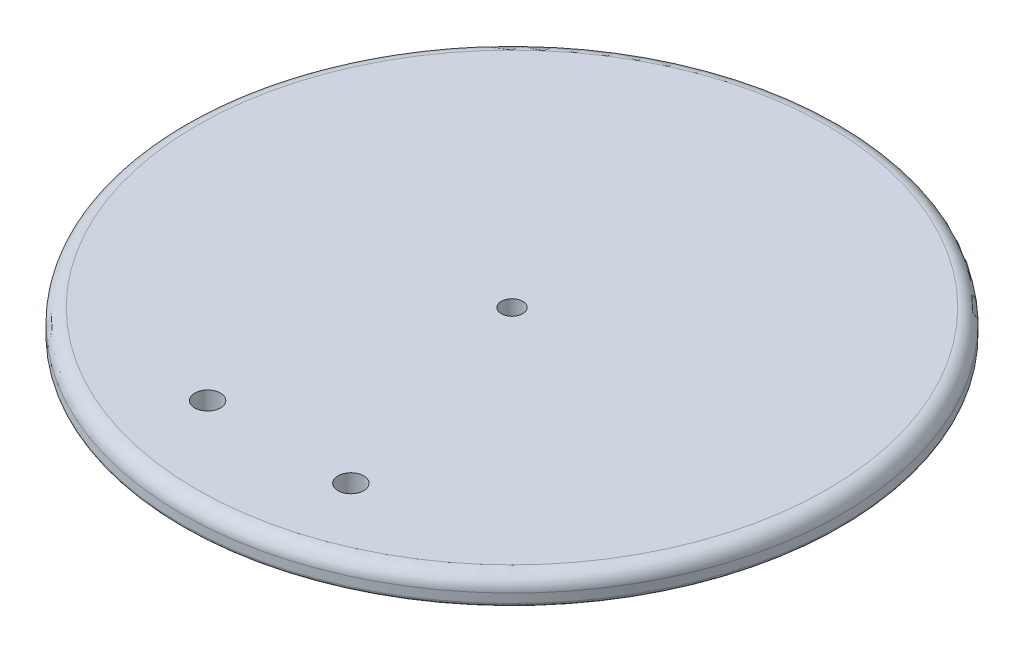
ISO-10303-21;
HEADER;
FILE_DESCRIPTION(('STEP AP214'),'2;1');
FILE_NAME('part.step','',(''),(''),'','','');
FILE_SCHEMA(('AUTOMOTIVE_DESIGN { 1 0 10303 214 1 1 1 1 }'));
ENDSEC;
DATA;
#1=APPLICATION_CONTEXT('core data for automotive mechanical design processes');
#2=APPLICATION_PROTOCOL_DEFINITION('international standard','automotive_design',2000,#1);
#3=PRODUCT_CONTEXT('',#1,'mechanical');
#4=PRODUCT('Part','Part','',(#3));
#5=PRODUCT_RELATED_PRODUCT_CATEGORY('part','',(#4));
#6=PRODUCT_DEFINITION_FORMATION('','',#4);
#7=PRODUCT_DEFINITION_CONTEXT('part definition',#1,'design');
#8=PRODUCT_DEFINITION('design','',#6,#7);
#9=PRODUCT_DEFINITION_SHAPE('','',#8);
#10=(LENGTH_UNIT() NAMED_UNIT(*) SI_UNIT(.MILLI.,.METRE.));
#11=(NAMED_UNIT(*) PLANE_ANGLE_UNIT() SI_UNIT($,.RADIAN.));
#12=(NAMED_UNIT(*) SI_UNIT($,.STERADIAN.) SOLID_ANGLE_UNIT());
#13=UNCERTAINTY_MEASURE_WITH_UNIT(LENGTH_MEASURE(1.E-05),#10,'distance_accuracy_value','');
#14=(GEOMETRIC_REPRESENTATION_CONTEXT(3) GLOBAL_UNCERTAINTY_ASSIGNED_CONTEXT((#13)) GLOBAL_UNIT_ASSIGNED_CONTEXT((#10,
#11,#12)) REPRESENTATION_CONTEXT('',''));
#15=CARTESIAN_POINT('',(0.,0.,0.));
#16=DIRECTION('',(0.,0.,1.));
#17=DIRECTION('',(1.,0.,0.));
#18=AXIS2_PLACEMENT_3D('',#15,#16,#17);
#19=CARTESIAN_POINT('',(59.332644984238,3.41374916925297,-36.8638511188806));
#20=DIRECTION('',(0.,1.,0.));
#21=DIRECTION('',(0.,0.,1.));
#22=AXIS2_PLACEMENT_3D('',#19,#20,#21);
#23=PLANE('',#22);
#24=CARTESIAN_POINT('',(59.332644984238,3.41374916925297,-36.8638511188806));
#25=DIRECTION('',(0.,1.,0.));
#26=DIRECTION('',(0.,0.,1.));
#27=AXIS2_PLACEMENT_3D('',#24,#25,#26);
#28=CIRCLE('',#27,57.785);
#29=CARTESIAN_POINT('',(59.332644984238,3.41374916925297,20.9211488811194));
#30=VERTEX_POINT('',#29);
#31=EDGE_CURVE('E11',#30,#30,#28,.F.);
#32=ORIENTED_EDGE('',*,*,#31,.T.);
#33=EDGE_LOOP('',(#32));
#34=FACE_BOUND('',#33,.T.);
#35=CARTESIAN_POINT('',(46.6326449842379,3.41374916925297,4.39807767939825));
#36=DIRECTION('',(0.,1.,0.));
#37=DIRECTION('',(0.,0.,1.));
#38=AXIS2_PLACEMENT_3D('',#35,#36,#37);
#39=CIRCLE('',#38,2.286);
#40=CARTESIAN_POINT('',(46.6326449842379,3.41374916925297,6.68407767939825));
#41=VERTEX_POINT('',#40);
#42=EDGE_CURVE('E220',#41,#41,#39,.F.);
#43=ORIENTED_EDGE('',*,*,#42,.F.);
#44=EDGE_LOOP('',(#43));
#45=FACE_BOUND('',#44,.T.);
#46=CARTESIAN_POINT('',(72.0326449842379,3.41374916925297,4.39807767939825));
#47=DIRECTION('',(0.,1.,0.));
#48=DIRECTION('',(0.,0.,1.));
#49=AXIS2_PLACEMENT_3D('',#46,#47,#48);
#50=CIRCLE('',#49,2.28599999999999);
#51=CARTESIAN_POINT('',(72.0326449842379,3.41374916925297,6.68407767939824));
#52=VERTEX_POINT('',#51);
#53=EDGE_CURVE('E219',#52,#52,#50,.F.);
#54=ORIENTED_EDGE('',*,*,#53,.F.);
#55=EDGE_LOOP('',(#54));
#56=FACE_BOUND('',#55,.T.);
#57=CARTESIAN_POINT('',(58.9768398177988,3.41374916925297,-37.0907340514422));
#58=DIRECTION('',(0.,1.,0.));
#59=DIRECTION('',(0.,0.,1.));
#60=AXIS2_PLACEMENT_3D('',#57,#58,#59);
#61=CIRCLE('',#60,6.39864801940768);
#62=CARTESIAN_POINT('',(55.4593357756066,3.41374916925297,-42.4358123286456));
#63=VERTEX_POINT('',#62);
#64=CARTESIAN_POINT('',(52.7610898787353,3.41374916925297,-38.6096643234767));
#65=VERTEX_POINT('',#64);
#66=EDGE_CURVE('E150',#63,#65,#61,.T.);
#67=ORIENTED_EDGE('',*,*,#66,.T.);
#68=CARTESIAN_POINT('',(58.9111504046938,3.41374916925297,-36.8434672780378));
#69=DIRECTION('',(0.,1.,0.));
#70=DIRECTION('',(0.,0.,1.));
#71=AXIS2_PLACEMENT_3D('',#68,#69,#70);
#72=CIRCLE('',#71,6.39864801940768);
#73=CARTESIAN_POINT('',(53.2046718908221,3.41374916925297,-33.948851682317));
#74=VERTEX_POINT('',#73);
#75=EDGE_CURVE('E139',#65,#74,#72,.T.);
#76=ORIENTED_EDGE('',*,*,#75,.T.);
#77=DIRECTION('',(-0.120272410735966,0.,0.992740926534088));
#78=VECTOR('',#77,1.);
#79=CARTESIAN_POINT('',(51.5432137530939,3.41374916925297,-20.2350042508657));
#80=LINE('',#79,#78);
#81=CARTESIAN_POINT('',(51.5432137530939,3.41374916925297,-20.2350042508657));
#82=VERTEX_POINT('',#81);
#83=EDGE_CURVE('E293',#74,#82,#80,.T.);
#84=ORIENTED_EDGE('',*,*,#83,.T.);
#85=CARTESIAN_POINT('',(54.9211326890478,3.41374916925297,-20.1029097134891));
#86=DIRECTION('',(0.,1.,0.));
#87=DIRECTION('',(0.,0.,1.));
#88=AXIS2_PLACEMENT_3D('',#85,#86,#87);
#89=CIRCLE('',#88,3.38050074762318);
#90=CARTESIAN_POINT('',(54.0147123283669,3.41374916925297,-16.8461955052074));
#91=VERTEX_POINT('',#90);
#92=EDGE_CURVE('E295',#82,#91,#89,.T.);
#93=ORIENTED_EDGE('',*,*,#92,.T.);
#94=CARTESIAN_POINT('',(54.8440998131529,3.41374916925297,-20.1233744299476));
#95=DIRECTION('',(0.,1.,0.));
#96=DIRECTION('',(0.,0.,1.));
#97=AXIS2_PLACEMENT_3D('',#94,#95,#96);
#98=CIRCLE('',#97,3.38050074762316);
#99=CARTESIAN_POINT('',(57.8422070726946,3.41374916925297,-18.5616003858028));
#100=VERTEX_POINT('',#99);
#101=EDGE_CURVE('E297',#91,#100,#98,.T.);
#102=ORIENTED_EDGE('',*,*,#101,.T.);
#103=DIRECTION('',(0.388279898284772,0.,-0.92154149151732));
#104=VECTOR('',#103,1.);
#105=CARTESIAN_POINT('',(57.8422070726946,3.41374916925297,-18.5616003858028));
#106=LINE('',#105,#104);
#107=CARTESIAN_POINT('',(63.2059541928693,3.41374916925297,-31.2918899091155));
#108=VERTEX_POINT('',#107);
#109=EDGE_CURVE('E302',#100,#108,#106,.T.);
#110=ORIENTED_EDGE('',*,*,#109,.T.);
#111=CARTESIAN_POINT('',(59.6884501506771,3.41374916925297,-36.6369681863189));
#112=DIRECTION('',(0.,1.,0.));
#113=DIRECTION('',(0.,0.,1.));
#114=AXIS2_PLACEMENT_3D('',#111,#112,#113);
#115=CIRCLE('',#114,6.39864801940768);
#116=CARTESIAN_POINT('',(65.9042000897406,3.41374916925297,-35.1180379142844));
#117=VERTEX_POINT('',#116);
#118=EDGE_CURVE('E305',#108,#117,#115,.T.);
#119=ORIENTED_EDGE('',*,*,#118,.T.);
#120=CARTESIAN_POINT('',(59.7541395637821,3.41374916925297,-36.8842349597234));
#121=DIRECTION('',(0.,1.,0.));
#122=DIRECTION('',(0.,0.,1.));
#123=AXIS2_PLACEMENT_3D('',#120,#121,#122);
#124=CIRCLE('',#123,6.39864801940769);
#125=CARTESIAN_POINT('',(65.4606180776538,3.41374916925297,-39.7788505554441));
#126=VERTEX_POINT('',#125);
#127=EDGE_CURVE('E308',#117,#126,#124,.T.);
#128=ORIENTED_EDGE('',*,*,#127,.T.);
#129=DIRECTION('',(0.120272410735967,0.,-0.992740926534088));
#130=VECTOR('',#129,1.);
#131=CARTESIAN_POINT('',(67.122076215382,3.41374916925297,-53.4926979868955));
#132=LINE('',#131,#130);
#133=CARTESIAN_POINT('',(67.122076215382,3.41374916925297,-53.4926979868955));
#134=VERTEX_POINT('',#133);
#135=EDGE_CURVE('E311',#126,#134,#132,.T.);
#136=ORIENTED_EDGE('',*,*,#135,.T.);
#137=CARTESIAN_POINT('',(63.7441572794281,3.41374916925297,-53.624792524272));
#138=DIRECTION('',(0.,1.,0.));
#139=DIRECTION('',(0.,0.,1.));
#140=AXIS2_PLACEMENT_3D('',#137,#138,#139);
#141=CIRCLE('',#140,3.38050074762317);
#142=CARTESIAN_POINT('',(64.650577640109,3.41374916925297,-56.8815067325537));
#143=VERTEX_POINT('',#142);
#144=EDGE_CURVE('E314',#134,#143,#141,.T.);
#145=ORIENTED_EDGE('',*,*,#144,.T.);
#146=CARTESIAN_POINT('',(63.8211901553229,3.41374916925297,-53.6043278078136));
#147=DIRECTION('',(0.,1.,0.));
#148=DIRECTION('',(0.,0.,1.));
#149=AXIS2_PLACEMENT_3D('',#146,#147,#148);
#150=CIRCLE('',#149,3.38050074762318);
#151=CARTESIAN_POINT('',(60.8230828957813,3.41374916925297,-55.1661018519583));
#152=VERTEX_POINT('',#151);
#153=EDGE_CURVE('E162',#143,#152,#150,.T.);
#154=ORIENTED_EDGE('',*,*,#153,.T.);
#155=DIRECTION('',(-0.388279898284767,0.,0.921541491517322));
#156=VECTOR('',#155,1.);
#157=CARTESIAN_POINT('',(60.8230828957813,3.41374916925297,-55.1661018519583));
#158=LINE('',#157,#156);
#159=EDGE_CURVE('E158',#152,#63,#158,.T.);
#160=ORIENTED_EDGE('',*,*,#159,.T.);
#161=EDGE_LOOP('',(#67,#76,#84,#93,#102,#110,#119,#128,#136,#145,#154,#160));
#162=FACE_BOUND('',#161,.T.);
#163=ADVANCED_FACE('F53',(#34,#45,#56,#162),#23,.F.);
#164=CARTESIAN_POINT('',(59.3326449842379,8.17624916925297,-36.8638511188806));
#165=DIRECTION('',(0.,1.,0.));
#166=DIRECTION('',(0.,0.,1.));
#167=AXIS2_PLACEMENT_3D('',#164,#165,#166);
#168=PLANE('',#167);
#169=CARTESIAN_POINT('',(72.0326449842379,8.17624916925297,4.39807767939825));
#170=DIRECTION('',(0.,1.,0.));
#171=DIRECTION('',(0.,0.,1.));
#172=AXIS2_PLACEMENT_3D('',#169,#170,#171);
#173=CIRCLE('',#172,2.28599999999999);
#174=CARTESIAN_POINT('',(72.0326449842379,8.17624916925297,6.68407767939824));
#175=VERTEX_POINT('',#174);
#176=EDGE_CURVE('E216',#175,#175,#173,.T.);
#177=ORIENTED_EDGE('',*,*,#176,.F.);
#178=EDGE_LOOP('',(#177));
#179=FACE_BOUND('',#178,.T.);
#180=CARTESIAN_POINT('',(46.6326449842379,8.17624916925297,4.39807767939825));
#181=DIRECTION('',(0.,1.,0.));
#182=DIRECTION('',(0.,0.,1.));
#183=AXIS2_PLACEMENT_3D('',#180,#181,#182);
#184=CIRCLE('',#183,2.286);
#185=CARTESIAN_POINT('',(46.6326449842379,8.17624916925297,6.68407767939825));
#186=VERTEX_POINT('',#185);
#187=EDGE_CURVE('E144',#186,#186,#184,.T.);
#188=ORIENTED_EDGE('',*,*,#187,.F.);
#189=EDGE_LOOP('',(#188));
#190=FACE_BOUND('',#189,.T.);
#191=CARTESIAN_POINT('',(59.332644984238,8.17624916925297,-36.8638511188806));
#192=DIRECTION('',(0.,1.,0.));
#193=DIRECTION('',(0.,0.,1.));
#194=AXIS2_PLACEMENT_3D('',#191,#192,#193);
#195=CIRCLE('',#194,55.88);
#196=CARTESIAN_POINT('',(59.332644984238,8.17624916925297,19.0161488811194));
#197=VERTEX_POINT('',#196);
#198=EDGE_CURVE('E231',#197,#197,#195,.T.);
#199=ORIENTED_EDGE('',*,*,#198,.T.);
#200=EDGE_LOOP('',(#199));
#201=FACE_BOUND('',#200,.T.);
#202=CARTESIAN_POINT('',(59.3326449842379,8.17624916925297,-36.8638511188806));
#203=DIRECTION('',(0.,1.,0.));
#204=DIRECTION('',(0.,0.,1.));
#205=AXIS2_PLACEMENT_3D('',#202,#203,#204);
#206=CIRCLE('',#205,1.905);
#207=CARTESIAN_POINT('',(59.3326449842379,8.17624916925297,-34.9588511188806));
#208=VERTEX_POINT('',#207);
#209=EDGE_CURVE('E223',#208,#208,#206,.F.);
#210=ORIENTED_EDGE('',*,*,#209,.T.);
#211=EDGE_LOOP('',(#210));
#212=FACE_BOUND('',#211,.T.);
#213=ADVANCED_FACE('F261',(#179,#190,#201,#212),#168,.T.);
#214=CARTESIAN_POINT('',(59.332644984238,12.938749169253,-36.8638511188806));
#215=DIRECTION('',(0.,-1.,0.));
#216=DIRECTION('',(0.,0.,-1.));
#217=AXIS2_PLACEMENT_3D('',#214,#215,#216);
#218=CYLINDRICAL_SURFACE('',#217,58.42);
#219=CARTESIAN_POINT('',(59.332644984238,4.04874916925297,-36.8638511188806));
#220=DIRECTION('',(0.,1.,0.));
#221=DIRECTION('',(0.,0.,1.));
#222=AXIS2_PLACEMENT_3D('',#219,#220,#221);
#223=CIRCLE('',#222,58.42);
#224=CARTESIAN_POINT('',(59.332644984238,4.04874916925297,21.5561488811194));
#225=VERTEX_POINT('',#224);
#226=EDGE_CURVE('E61',#225,#225,#223,.T.);
#227=ORIENTED_EDGE('',*,*,#226,.T.);
#228=EDGE_LOOP('',(#227));
#229=FACE_BOUND('',#228,.T.);
#230=CARTESIAN_POINT('',(59.332644984238,5.63624916925297,-36.8638511188806));
#231=DIRECTION('',(0.,1.,0.));
#232=DIRECTION('',(0.,0.,1.));
#233=AXIS2_PLACEMENT_3D('',#230,#231,#232);
#234=CIRCLE('',#233,58.42);
#235=CARTESIAN_POINT('',(59.332644984238,5.63624916925297,21.5561488811194));
#236=VERTEX_POINT('',#235);
#237=EDGE_CURVE('E236',#236,#236,#234,.F.);
#238=ORIENTED_EDGE('',*,*,#237,.T.);
#239=EDGE_LOOP('',(#238));
#240=FACE_BOUND('',#239,.T.);
#241=ADVANCED_FACE('F241',(#229,#240),#218,.T.);
#242=CARTESIAN_POINT('',(54.8843452901975,4.81545432470032,-20.1196504860645));
#243=DIRECTION('',(0.,1.,0.));
#244=DIRECTION('',(0.,0.,1.));
#245=AXIS2_PLACEMENT_3D('',#242,#243,#244);
#246=PLANE('',#245);
#247=CARTESIAN_POINT('',(59.3326449842379,4.81545432470032,-36.8638511188806));
#248=DIRECTION('',(0.,-1.,0.));
#249=DIRECTION('',(0.,0.,-1.));
#250=AXIS2_PLACEMENT_3D('',#247,#248,#249);
#251=CIRCLE('',#250,1.905);
#252=CARTESIAN_POINT('',(59.3326449842379,4.81545432470032,-38.7688511188806));
#253=VERTEX_POINT('',#252);
#254=EDGE_CURVE('E228',#253,#253,#251,.T.);
#255=ORIENTED_EDGE('',*,*,#254,.F.);
#256=EDGE_LOOP('',(#255));
#257=FACE_BOUND('',#256,.T.);
#258=CARTESIAN_POINT('',(58.9768398177988,4.81545432470032,-37.0907340514422));
#259=DIRECTION('',(0.,-1.,0.));
#260=DIRECTION('',(0.,0.,-1.));
#261=AXIS2_PLACEMENT_3D('',#258,#259,#260);
#262=CIRCLE('',#261,6.39864801940768);
#263=CARTESIAN_POINT('',(52.7610898787353,4.81545432470032,-38.6096643234767));
#264=VERTEX_POINT('',#263);
#265=CARTESIAN_POINT('',(55.4593357756066,4.81545432470032,-42.4358123286456));
#266=VERTEX_POINT('',#265);
#267=EDGE_CURVE('E153',#264,#266,#262,.T.);
#268=ORIENTED_EDGE('',*,*,#267,.T.);
#269=DIRECTION('',(0.388279898284767,0.,-0.921541491517322));
#270=VECTOR('',#269,1.);
#271=CARTESIAN_POINT('',(60.8230828957813,4.81545432470032,-55.1661018519583));
#272=LINE('',#271,#270);
#273=CARTESIAN_POINT('',(60.8230828957813,4.81545432470032,-55.1661018519583));
#274=VERTEX_POINT('',#273);
#275=EDGE_CURVE('E160',#266,#274,#272,.T.);
#276=ORIENTED_EDGE('',*,*,#275,.T.);
#277=CARTESIAN_POINT('',(63.8211901553229,4.81545432470032,-53.6043278078136));
#278=DIRECTION('',(0.,-1.,0.));
#279=DIRECTION('',(0.,0.,-1.));
#280=AXIS2_PLACEMENT_3D('',#277,#278,#279);
#281=CIRCLE('',#280,3.38050074762318);
#282=CARTESIAN_POINT('',(64.650577640109,4.81545432470032,-56.8815067325537));
#283=VERTEX_POINT('',#282);
#284=EDGE_CURVE('E168',#274,#283,#281,.T.);
#285=ORIENTED_EDGE('',*,*,#284,.T.);
#286=CARTESIAN_POINT('',(63.7441572794281,4.81545432470032,-53.624792524272));
#287=DIRECTION('',(0.,-1.,0.));
#288=DIRECTION('',(0.,0.,1.));
#289=AXIS2_PLACEMENT_3D('',#286,#287,#288);
#290=CIRCLE('',#289,3.38050074762317);
#291=CARTESIAN_POINT('',(67.122076215382,4.81545432470032,-53.4926979868955));
#292=VERTEX_POINT('',#291);
#293=EDGE_CURVE('E171',#283,#292,#290,.T.);
#294=ORIENTED_EDGE('',*,*,#293,.T.);
#295=DIRECTION('',(-0.120272410735967,0.,0.992740926534088));
#296=VECTOR('',#295,1.);
#297=CARTESIAN_POINT('',(67.122076215382,4.81545432470032,-53.4926979868955));
#298=LINE('',#297,#296);
#299=CARTESIAN_POINT('',(65.4606180776538,4.81545432470032,-39.7788505554441));
#300=VERTEX_POINT('',#299);
#301=EDGE_CURVE('E174',#292,#300,#298,.T.);
#302=ORIENTED_EDGE('',*,*,#301,.T.);
#303=CARTESIAN_POINT('',(59.7541395637821,4.81545432470032,-36.8842349597234));
#304=DIRECTION('',(0.,-1.,0.));
#305=DIRECTION('',(0.,0.,1.));
#306=AXIS2_PLACEMENT_3D('',#303,#304,#305);
#307=CIRCLE('',#306,6.39864801940769);
#308=CARTESIAN_POINT('',(65.9042000897406,4.81545432470032,-35.1180379142844));
#309=VERTEX_POINT('',#308);
#310=EDGE_CURVE('E177',#300,#309,#307,.T.);
#311=ORIENTED_EDGE('',*,*,#310,.T.);
#312=CARTESIAN_POINT('',(59.6884501506771,4.81545432470032,-36.6369681863189));
#313=DIRECTION('',(0.,-1.,0.));
#314=DIRECTION('',(0.,0.,-1.));
#315=AXIS2_PLACEMENT_3D('',#312,#313,#314);
#316=CIRCLE('',#315,6.39864801940768);
#317=CARTESIAN_POINT('',(63.2059541928693,4.81545432470032,-31.2918899091155));
#318=VERTEX_POINT('',#317);
#319=EDGE_CURVE('E180',#309,#318,#316,.T.);
#320=ORIENTED_EDGE('',*,*,#319,.T.);
#321=DIRECTION('',(-0.388279898284772,0.,0.92154149151732));
#322=VECTOR('',#321,1.);
#323=CARTESIAN_POINT('',(57.8422070726946,4.81545432470032,-18.5616003858028));
#324=LINE('',#323,#322);
#325=CARTESIAN_POINT('',(57.8422070726946,4.81545432470032,-18.5616003858028));
#326=VERTEX_POINT('',#325);
#327=EDGE_CURVE('E183',#318,#326,#324,.T.);
#328=ORIENTED_EDGE('',*,*,#327,.T.);
#329=CARTESIAN_POINT('',(54.8440998131529,4.81545432470032,-20.1233744299476));
#330=DIRECTION('',(0.,-1.,0.));
#331=DIRECTION('',(0.,0.,-1.));
#332=AXIS2_PLACEMENT_3D('',#329,#330,#331);
#333=CIRCLE('',#332,3.38050074762316);
#334=CARTESIAN_POINT('',(54.0147123283669,4.81545432470032,-16.8461955052074));
#335=VERTEX_POINT('',#334);
#336=EDGE_CURVE('E186',#326,#335,#333,.T.);
#337=ORIENTED_EDGE('',*,*,#336,.T.);
#338=CARTESIAN_POINT('',(54.9211326890478,4.81545432470032,-20.1029097134891));
#339=DIRECTION('',(0.,-1.,0.));
#340=DIRECTION('',(0.,0.,1.));
#341=AXIS2_PLACEMENT_3D('',#338,#339,#340);
#342=CIRCLE('',#341,3.38050074762318);
#343=CARTESIAN_POINT('',(51.5432137530939,4.81545432470032,-20.2350042508657));
#344=VERTEX_POINT('',#343);
#345=EDGE_CURVE('E189',#335,#344,#342,.T.);
#346=ORIENTED_EDGE('',*,*,#345,.T.);
#347=DIRECTION('',(0.120272410735966,0.,-0.992740926534088));
#348=VECTOR('',#347,1.);
#349=CARTESIAN_POINT('',(51.5432137530939,4.81545432470032,-20.2350042508657));
#350=LINE('',#349,#348);
#351=CARTESIAN_POINT('',(53.2046718908221,4.81545432470032,-33.948851682317));
#352=VERTEX_POINT('',#351);
#353=EDGE_CURVE('E192',#344,#352,#350,.T.);
#354=ORIENTED_EDGE('',*,*,#353,.T.);
#355=CARTESIAN_POINT('',(58.9111504046938,4.81545432470032,-36.8434672780378));
#356=DIRECTION('',(0.,-1.,0.));
#357=DIRECTION('',(0.,0.,1.));
#358=AXIS2_PLACEMENT_3D('',#355,#356,#357);
#359=CIRCLE('',#358,6.39864801940768);
#360=EDGE_CURVE('E154',#352,#264,#359,.T.);
#361=ORIENTED_EDGE('',*,*,#360,.T.);
#362=EDGE_LOOP('',(#268,#276,#285,#294,#302,#311,#320,#328,#337,#346,#354,#361));
#363=FACE_BOUND('',#362,.T.);
#364=ADVANCED_FACE('F272',(#257,#363),#246,.F.);
#365=CARTESIAN_POINT('',(59.3326449842379,8.17724916925297,-36.8638511188806));
#366=DIRECTION('',(0.,-1.,0.));
#367=DIRECTION('',(0.,0.,-1.));
#368=AXIS2_PLACEMENT_3D('',#365,#366,#367);
#369=CYLINDRICAL_SURFACE('',#368,1.905);
#370=ORIENTED_EDGE('',*,*,#209,.F.);
#371=EDGE_LOOP('',(#370));
#372=FACE_BOUND('',#371,.T.);
#373=ORIENTED_EDGE('',*,*,#254,.T.);
#374=EDGE_LOOP('',(#373));
#375=FACE_BOUND('',#374,.T.);
#376=ADVANCED_FACE('F257',(#372,#375),#369,.F.);
#377=CARTESIAN_POINT('',(59.332644984238,5.63624916925297,-36.8638511188806));
#378=DIRECTION('',(0.,1.,0.));
#379=DIRECTION('',(0.,0.,1.));
#380=AXIS2_PLACEMENT_3D('',#377,#378,#379);
#381=TOROIDAL_SURFACE('',#380,55.88,2.54);
#382=ORIENTED_EDGE('',*,*,#237,.F.);
#383=EDGE_LOOP('',(#382));
#384=FACE_BOUND('',#383,.T.);
#385=ORIENTED_EDGE('',*,*,#198,.F.);
#386=EDGE_LOOP('',(#385));
#387=FACE_BOUND('',#386,.T.);
#388=ADVANCED_FACE('F246',(#384,#387),#381,.T.);
#389=CARTESIAN_POINT('',(59.332644984238,4.04874916925297,-36.8638511188806));
#390=DIRECTION('',(0.,1.,0.));
#391=DIRECTION('',(0.,0.,1.));
#392=AXIS2_PLACEMENT_3D('',#389,#390,#391);
#393=TOROIDAL_SURFACE('',#392,57.785,0.635);
#394=ORIENTED_EDGE('',*,*,#31,.F.);
#395=EDGE_LOOP('',(#394));
#396=FACE_BOUND('',#395,.T.);
#397=ORIENTED_EDGE('',*,*,#226,.F.);
#398=EDGE_LOOP('',(#397));
#399=FACE_BOUND('',#398,.T.);
#400=ADVANCED_FACE('F55',(#396,#399),#393,.T.);
#401=CARTESIAN_POINT('',(46.6326449842379,3.41274916925296,4.39807767939825));
#402=DIRECTION('',(0.,1.,0.));
#403=DIRECTION('',(0.,0.,1.));
#404=AXIS2_PLACEMENT_3D('',#401,#402,#403);
#405=CYLINDRICAL_SURFACE('',#404,2.286);
#406=ORIENTED_EDGE('',*,*,#187,.T.);
#407=EDGE_LOOP('',(#406));
#408=FACE_BOUND('',#407,.T.);
#409=ORIENTED_EDGE('',*,*,#42,.T.);
#410=EDGE_LOOP('',(#409));
#411=FACE_BOUND('',#410,.T.);
#412=ADVANCED_FACE('F245',(#408,#411),#405,.F.);
#413=CARTESIAN_POINT('',(72.0326449842379,3.41274916925296,4.39807767939825));
#414=DIRECTION('',(0.,1.,0.));
#415=DIRECTION('',(0.,0.,1.));
#416=AXIS2_PLACEMENT_3D('',#413,#414,#415);
#417=CYLINDRICAL_SURFACE('',#416,2.28599999999999);
#418=ORIENTED_EDGE('',*,*,#176,.T.);
#419=EDGE_LOOP('',(#418));
#420=FACE_BOUND('',#419,.T.);
#421=ORIENTED_EDGE('',*,*,#53,.T.);
#422=EDGE_LOOP('',(#421));
#423=FACE_BOUND('',#422,.T.);
#424=ADVANCED_FACE('F253',(#420,#423),#417,.F.);
#425=CARTESIAN_POINT('',(58.9768398177988,3.41274916925296,-37.0907340514422));
#426=DIRECTION('',(0.,1.,0.));
#427=DIRECTION('',(0.,0.,1.));
#428=AXIS2_PLACEMENT_3D('',#425,#426,#427);
#429=CYLINDRICAL_SURFACE('',#428,6.39864801940768);
#430=DIRECTION('',(0.,1.,0.));
#431=VECTOR('',#430,1.);
#432=CARTESIAN_POINT('',(55.4593357756066,3.41274916925296,-42.4358123286456));
#433=LINE('',#432,#431);
#434=EDGE_CURVE('E145',#63,#266,#433,.T.);
#435=ORIENTED_EDGE('',*,*,#434,.T.);
#436=ORIENTED_EDGE('',*,*,#267,.F.);
#437=DIRECTION('',(0.,1.,0.));
#438=VECTOR('',#437,1.);
#439=CARTESIAN_POINT('',(52.7610898787353,3.41274916925296,-38.6096643234767));
#440=LINE('',#439,#438);
#441=EDGE_CURVE('E73',#65,#264,#440,.T.);
#442=ORIENTED_EDGE('',*,*,#441,.F.);
#443=ORIENTED_EDGE('',*,*,#66,.F.);
#444=EDGE_LOOP('',(#435,#436,#442,#443));
#445=FACE_BOUND('',#444,.T.);
#446=ADVANCED_FACE('F149',(#445),#429,.F.);
#447=CARTESIAN_POINT('',(60.8230828957813,3.41274916925296,-55.1661018519583));
#448=DIRECTION('',(0.921541491517322,0.,0.388279898284767));
#449=DIRECTION('',(0.388279898284767,0.,-0.921541491517322));
#450=AXIS2_PLACEMENT_3D('',#447,#448,#449);
#451=PLANE('',#450);
#452=DIRECTION('',(0.,1.,0.));
#453=VECTOR('',#452,1.);
#454=CARTESIAN_POINT('',(60.8230828957813,3.41274916925296,-55.1661018519583));
#455=LINE('',#454,#453);
#456=EDGE_CURVE('E213',#152,#274,#455,.T.);
#457=ORIENTED_EDGE('',*,*,#456,.T.);
#458=ORIENTED_EDGE('',*,*,#275,.F.);
#459=ORIENTED_EDGE('',*,*,#434,.F.);
#460=ORIENTED_EDGE('',*,*,#159,.F.);
#461=EDGE_LOOP('',(#457,#458,#459,#460));
#462=FACE_BOUND('',#461,.T.);
#463=ADVANCED_FACE('F368',(#462),#451,.T.);
#464=CARTESIAN_POINT('',(63.8211901553229,3.41274916925296,-53.6043278078136));
#465=DIRECTION('',(0.,1.,0.));
#466=DIRECTION('',(0.,0.,1.));
#467=AXIS2_PLACEMENT_3D('',#464,#465,#466);
#468=CYLINDRICAL_SURFACE('',#467,3.38050074762318);
#469=DIRECTION('',(0.,1.,0.));
#470=VECTOR('',#469,1.);
#471=CARTESIAN_POINT('',(64.650577640109,3.41274916925296,-56.8815067325537));
#472=LINE('',#471,#470);
#473=EDGE_CURVE('E211',#143,#283,#472,.T.);
#474=ORIENTED_EDGE('',*,*,#473,.T.);
#475=ORIENTED_EDGE('',*,*,#284,.F.);
#476=ORIENTED_EDGE('',*,*,#456,.F.);
#477=ORIENTED_EDGE('',*,*,#153,.F.);
#478=EDGE_LOOP('',(#474,#475,#476,#477));
#479=FACE_BOUND('',#478,.T.);
#480=ADVANCED_FACE('F319',(#479),#468,.F.);
#481=CARTESIAN_POINT('',(63.7441572794281,3.41274916925296,-53.624792524272));
#482=DIRECTION('',(0.,1.,0.));
#483=DIRECTION('',(0.,0.,1.));
#484=AXIS2_PLACEMENT_3D('',#481,#482,#483);
#485=CYLINDRICAL_SURFACE('',#484,3.38050074762317);
#486=DIRECTION('',(0.,1.,0.));
#487=VECTOR('',#486,1.);
#488=CARTESIAN_POINT('',(67.122076215382,3.41274916925296,-53.4926979868955));
#489=LINE('',#488,#487);
#490=EDGE_CURVE('E209',#134,#292,#489,.T.);
#491=ORIENTED_EDGE('',*,*,#490,.T.);
#492=ORIENTED_EDGE('',*,*,#293,.F.);
#493=ORIENTED_EDGE('',*,*,#473,.F.);
#494=ORIENTED_EDGE('',*,*,#144,.F.);
#495=EDGE_LOOP('',(#491,#492,#493,#494));
#496=FACE_BOUND('',#495,.T.);
#497=ADVANCED_FACE('F322',(#496),#485,.F.);
#498=CARTESIAN_POINT('',(67.122076215382,3.41274916925296,-53.4926979868955));
#499=DIRECTION('',(-0.992740926534088,0.,-0.120272410735967));
#500=DIRECTION('',(-0.120272410735967,0.,0.992740926534088));
#501=AXIS2_PLACEMENT_3D('',#498,#499,#500);
#502=PLANE('',#501);
#503=DIRECTION('',(0.,1.,0.));
#504=VECTOR('',#503,1.);
#505=CARTESIAN_POINT('',(65.4606180776538,3.41274916925296,-39.7788505554441));
#506=LINE('',#505,#504);
#507=EDGE_CURVE('E207',#126,#300,#506,.T.);
#508=ORIENTED_EDGE('',*,*,#507,.T.);
#509=ORIENTED_EDGE('',*,*,#301,.F.);
#510=ORIENTED_EDGE('',*,*,#490,.F.);
#511=ORIENTED_EDGE('',*,*,#135,.F.);
#512=EDGE_LOOP('',(#508,#509,#510,#511));
#513=FACE_BOUND('',#512,.T.);
#514=ADVANCED_FACE('F327',(#513),#502,.T.);
#515=CARTESIAN_POINT('',(59.7541395637821,3.41274916925296,-36.8842349597234));
#516=DIRECTION('',(0.,1.,0.));
#517=DIRECTION('',(0.,0.,1.));
#518=AXIS2_PLACEMENT_3D('',#515,#516,#517);
#519=CYLINDRICAL_SURFACE('',#518,6.39864801940769);
#520=DIRECTION('',(0.,1.,0.));
#521=VECTOR('',#520,1.);
#522=CARTESIAN_POINT('',(65.9042000897406,3.41274916925296,-35.1180379142844));
#523=LINE('',#522,#521);
#524=EDGE_CURVE('E205',#117,#309,#523,.T.);
#525=ORIENTED_EDGE('',*,*,#524,.T.);
#526=ORIENTED_EDGE('',*,*,#310,.F.);
#527=ORIENTED_EDGE('',*,*,#507,.F.);
#528=ORIENTED_EDGE('',*,*,#127,.F.);
#529=EDGE_LOOP('',(#525,#526,#527,#528));
#530=FACE_BOUND('',#529,.T.);
#531=ADVANCED_FACE('F330',(#530),#519,.F.);
#532=CARTESIAN_POINT('',(59.6884501506771,3.41274916925296,-36.6369681863189));
#533=DIRECTION('',(0.,1.,0.));
#534=DIRECTION('',(0.,0.,1.));
#535=AXIS2_PLACEMENT_3D('',#532,#533,#534);
#536=CYLINDRICAL_SURFACE('',#535,6.39864801940768);
#537=DIRECTION('',(0.,1.,0.));
#538=VECTOR('',#537,1.);
#539=CARTESIAN_POINT('',(63.2059541928693,3.41274916925296,-31.2918899091155));
#540=LINE('',#539,#538);
#541=EDGE_CURVE('E203',#108,#318,#540,.T.);
#542=ORIENTED_EDGE('',*,*,#541,.T.);
#543=ORIENTED_EDGE('',*,*,#319,.F.);
#544=ORIENTED_EDGE('',*,*,#524,.F.);
#545=ORIENTED_EDGE('',*,*,#118,.F.);
#546=EDGE_LOOP('',(#542,#543,#544,#545));
#547=FACE_BOUND('',#546,.T.);
#548=ADVANCED_FACE('F334',(#547),#536,.F.);
#549=CARTESIAN_POINT('',(57.8422070726946,3.41274916925296,-18.5616003858028));
#550=DIRECTION('',(-0.92154149151732,0.,-0.388279898284772));
#551=DIRECTION('',(-0.388279898284772,0.,0.92154149151732));
#552=AXIS2_PLACEMENT_3D('',#549,#550,#551);
#553=PLANE('',#552);
#554=DIRECTION('',(0.,1.,0.));
#555=VECTOR('',#554,1.);
#556=CARTESIAN_POINT('',(57.8422070726946,3.41274916925296,-18.5616003858028));
#557=LINE('',#556,#555);
#558=EDGE_CURVE('E201',#100,#326,#557,.T.);
#559=ORIENTED_EDGE('',*,*,#558,.T.);
#560=ORIENTED_EDGE('',*,*,#327,.F.);
#561=ORIENTED_EDGE('',*,*,#541,.F.);
#562=ORIENTED_EDGE('',*,*,#109,.F.);
#563=EDGE_LOOP('',(#559,#560,#561,#562));
#564=FACE_BOUND('',#563,.T.);
#565=ADVANCED_FACE('F338',(#564),#553,.T.);
#566=CARTESIAN_POINT('',(54.8440998131529,3.41274916925296,-20.1233744299476));
#567=DIRECTION('',(0.,1.,0.));
#568=DIRECTION('',(0.,0.,1.));
#569=AXIS2_PLACEMENT_3D('',#566,#567,#568);
#570=CYLINDRICAL_SURFACE('',#569,3.38050074762316);
#571=DIRECTION('',(0.,1.,0.));
#572=VECTOR('',#571,1.);
#573=CARTESIAN_POINT('',(54.0147123283669,3.41274916925296,-16.8461955052074));
#574=LINE('',#573,#572);
#575=EDGE_CURVE('E199',#91,#335,#574,.T.);
#576=ORIENTED_EDGE('',*,*,#575,.T.);
#577=ORIENTED_EDGE('',*,*,#336,.F.);
#578=ORIENTED_EDGE('',*,*,#558,.F.);
#579=ORIENTED_EDGE('',*,*,#101,.F.);
#580=EDGE_LOOP('',(#576,#577,#578,#579));
#581=FACE_BOUND('',#580,.T.);
#582=ADVANCED_FACE('F342',(#581),#570,.F.);
#583=CARTESIAN_POINT('',(54.9211326890478,3.41274916925296,-20.1029097134891));
#584=DIRECTION('',(0.,1.,0.));
#585=DIRECTION('',(0.,0.,1.));
#586=AXIS2_PLACEMENT_3D('',#583,#584,#585);
#587=CYLINDRICAL_SURFACE('',#586,3.38050074762318);
#588=DIRECTION('',(0.,1.,0.));
#589=VECTOR('',#588,1.);
#590=CARTESIAN_POINT('',(51.5432137530939,3.41274916925296,-20.2350042508657));
#591=LINE('',#590,#589);
#592=EDGE_CURVE('E197',#82,#344,#591,.T.);
#593=ORIENTED_EDGE('',*,*,#592,.T.);
#594=ORIENTED_EDGE('',*,*,#345,.F.);
#595=ORIENTED_EDGE('',*,*,#575,.F.);
#596=ORIENTED_EDGE('',*,*,#92,.F.);
#597=EDGE_LOOP('',(#593,#594,#595,#596));
#598=FACE_BOUND('',#597,.T.);
#599=ADVANCED_FACE('F345',(#598),#587,.F.);
#600=CARTESIAN_POINT('',(51.5432137530939,3.41274916925296,-20.2350042508657));
#601=DIRECTION('',(0.992740926534088,0.,0.120272410735966));
#602=DIRECTION('',(0.120272410735966,0.,-0.992740926534088));
#603=AXIS2_PLACEMENT_3D('',#600,#601,#602);
#604=PLANE('',#603);
#605=DIRECTION('',(0.,1.,0.));
#606=VECTOR('',#605,1.);
#607=CARTESIAN_POINT('',(53.2046718908221,3.41274916925296,-33.948851682317));
#608=LINE('',#607,#606);
#609=EDGE_CURVE('E68',#74,#352,#608,.T.);
#610=ORIENTED_EDGE('',*,*,#609,.T.);
#611=ORIENTED_EDGE('',*,*,#353,.F.);
#612=ORIENTED_EDGE('',*,*,#592,.F.);
#613=ORIENTED_EDGE('',*,*,#83,.F.);
#614=EDGE_LOOP('',(#610,#611,#612,#613));
#615=FACE_BOUND('',#614,.T.);
#616=ADVANCED_FACE('F292',(#615),#604,.T.);
#617=CARTESIAN_POINT('',(58.9111504046938,3.41274916925296,-36.8434672780378));
#618=DIRECTION('',(0.,1.,0.));
#619=DIRECTION('',(0.,0.,1.));
#620=AXIS2_PLACEMENT_3D('',#617,#618,#619);
#621=CYLINDRICAL_SURFACE('',#620,6.39864801940768);
#622=ORIENTED_EDGE('',*,*,#441,.T.);
#623=ORIENTED_EDGE('',*,*,#360,.F.);
#624=ORIENTED_EDGE('',*,*,#609,.F.);
#625=ORIENTED_EDGE('',*,*,#75,.F.);
#626=EDGE_LOOP('',(#622,#623,#624,#625));
#627=FACE_BOUND('',#626,.T.);
#628=ADVANCED_FACE('F140',(#627),#621,.F.);
#629=CLOSED_SHELL('',(#163,#213,#241,#364,#376,#388,#400,#412,#424,#446,#463,#480,#497,#514,
#531,#548,#565,#582,#599,#616,#628));
#630=MANIFOLD_SOLID_BREP('B2',#629);
#631=ADVANCED_BREP_SHAPE_REPRESENTATION('',(#18,#630),#14);
#632=SHAPE_DEFINITION_REPRESENTATION(#9,#631);
ENDSEC;
END-ISO-10303-21;
